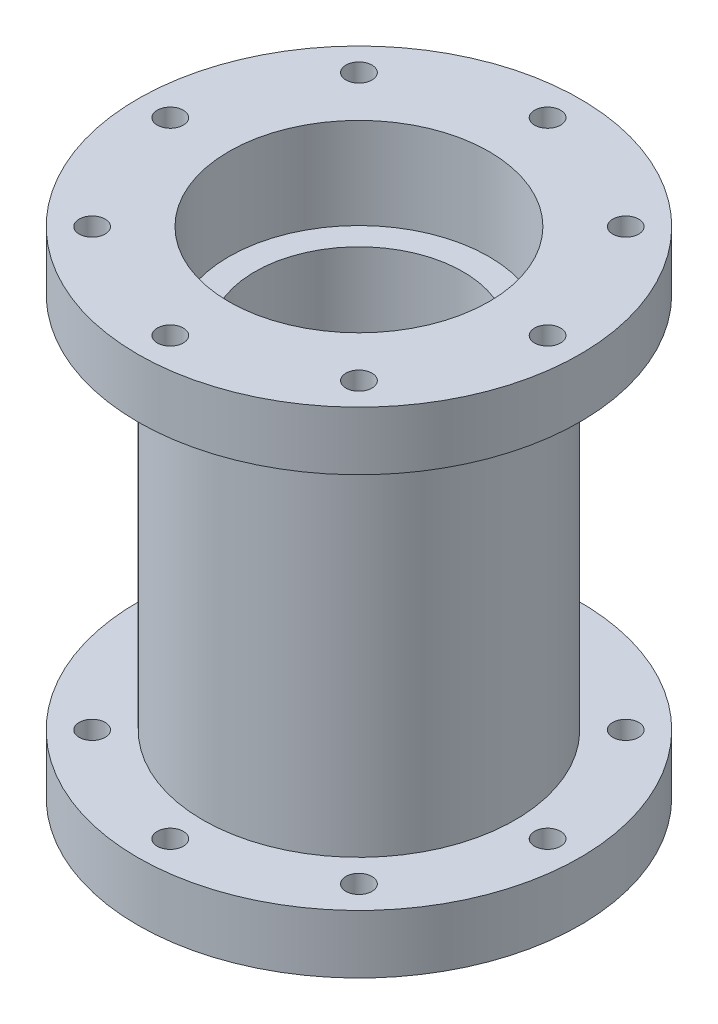
ISO-10303-21;
HEADER;
FILE_DESCRIPTION(('STEP AP214'),'2;1');
FILE_NAME('part.step','',(''),(''),'','','');
FILE_SCHEMA(('AUTOMOTIVE_DESIGN { 1 0 10303 214 1 1 1 1 }'));
ENDSEC;
DATA;
#1=APPLICATION_CONTEXT('core data for automotive mechanical design processes');
#2=APPLICATION_PROTOCOL_DEFINITION('international standard','automotive_design',2000,#1);
#3=PRODUCT_CONTEXT('',#1,'mechanical');
#4=PRODUCT('Part','Part','',(#3));
#5=PRODUCT_RELATED_PRODUCT_CATEGORY('part','',(#4));
#6=PRODUCT_DEFINITION_FORMATION('','',#4);
#7=PRODUCT_DEFINITION_CONTEXT('part definition',#1,'design');
#8=PRODUCT_DEFINITION('design','',#6,#7);
#9=PRODUCT_DEFINITION_SHAPE('','',#8);
#10=(LENGTH_UNIT() NAMED_UNIT(*) SI_UNIT(.MILLI.,.METRE.));
#11=(NAMED_UNIT(*) PLANE_ANGLE_UNIT() SI_UNIT($,.RADIAN.));
#12=(NAMED_UNIT(*) SI_UNIT($,.STERADIAN.) SOLID_ANGLE_UNIT());
#13=UNCERTAINTY_MEASURE_WITH_UNIT(LENGTH_MEASURE(1.E-05),#10,'distance_accuracy_value','');
#14=(GEOMETRIC_REPRESENTATION_CONTEXT(3) GLOBAL_UNCERTAINTY_ASSIGNED_CONTEXT((#13)) GLOBAL_UNIT_ASSIGNED_CONTEXT((#10,
#11,#12)) REPRESENTATION_CONTEXT('',''));
#15=CARTESIAN_POINT('',(0.,0.,0.));
#16=DIRECTION('',(0.,0.,1.));
#17=DIRECTION('',(1.,0.,0.));
#18=AXIS2_PLACEMENT_3D('',#15,#16,#17);
#19=CARTESIAN_POINT('',(0.,75.0967815173013,0.));
#20=DIRECTION('',(0.,1.,0.));
#21=DIRECTION('',(0.,0.,1.));
#22=AXIS2_PLACEMENT_3D('',#19,#20,#21);
#23=CYLINDRICAL_SURFACE('',#22,24.);
#24=CARTESIAN_POINT('',(0.,29.,0.));
#25=DIRECTION('',(0.,1.,0.));
#26=DIRECTION('',(0.,0.,1.));
#27=AXIS2_PLACEMENT_3D('',#24,#25,#26);
#28=CIRCLE('',#27,24.);
#29=CARTESIAN_POINT('',(0.,29.,24.));
#30=VERTEX_POINT('',#29);
#31=EDGE_CURVE('E90',#30,#30,#28,.T.);
#32=ORIENTED_EDGE('',*,*,#31,.F.);
#33=EDGE_LOOP('',(#32));
#34=FACE_BOUND('',#33,.T.);
#35=CARTESIAN_POINT('',(0.,-29.,0.));
#36=DIRECTION('',(0.,1.,0.));
#37=DIRECTION('',(0.,0.,1.));
#38=AXIS2_PLACEMENT_3D('',#35,#36,#37);
#39=CIRCLE('',#38,24.);
#40=CARTESIAN_POINT('',(0.,-29.,24.));
#41=VERTEX_POINT('',#40);
#42=EDGE_CURVE('E166',#41,#41,#39,.T.);
#43=ORIENTED_EDGE('',*,*,#42,.T.);
#44=EDGE_LOOP('',(#43));
#45=FACE_BOUND('',#44,.T.);
#46=ADVANCED_FACE('F37',(#34,#45),#23,.T.);
#47=CARTESIAN_POINT('',(-12.,-8.,0.));
#48=DIRECTION('',(0.,-1.,0.));
#49=DIRECTION('',(0.,0.,-1.));
#50=AXIS2_PLACEMENT_3D('',#47,#48,#49);
#51=PLANE('',#50);
#52=CARTESIAN_POINT('',(0.,-8.00000000000001,0.));
#53=DIRECTION('',(0.,1.,0.));
#54=DIRECTION('',(0.,0.,1.));
#55=AXIS2_PLACEMENT_3D('',#52,#53,#54);
#56=CIRCLE('',#55,12.);
#57=CARTESIAN_POINT('',(0.,-8.00000000000001,12.));
#58=VERTEX_POINT('',#57);
#59=EDGE_CURVE('E10',#58,#58,#56,.T.);
#60=ORIENTED_EDGE('',*,*,#59,.T.);
#61=EDGE_LOOP('',(#60));
#62=FACE_BOUND('',#61,.T.);
#63=CARTESIAN_POINT('',(0.,-8.00000000000001,0.));
#64=DIRECTION('',(0.,1.,0.));
#65=DIRECTION('',(0.,0.,1.));
#66=AXIS2_PLACEMENT_3D('',#63,#64,#65);
#67=CIRCLE('',#66,16.);
#68=CARTESIAN_POINT('',(0.,-8.00000000000001,16.));
#69=VERTEX_POINT('',#68);
#70=EDGE_CURVE('E81',#69,#69,#67,.T.);
#71=ORIENTED_EDGE('',*,*,#70,.F.);
#72=EDGE_LOOP('',(#71));
#73=FACE_BOUND('',#72,.T.);
#74=ADVANCED_FACE('F39',(#62,#73),#51,.T.);
#75=CARTESIAN_POINT('',(0.,75.0967815173013,0.));
#76=DIRECTION('',(0.,1.,0.));
#77=DIRECTION('',(0.,0.,1.));
#78=AXIS2_PLACEMENT_3D('',#75,#76,#77);
#79=CYLINDRICAL_SURFACE('',#78,12.);
#80=CARTESIAN_POINT('',(0.,8.00000000000001,0.));
#81=DIRECTION('',(0.,1.,0.));
#82=DIRECTION('',(0.,0.,1.));
#83=AXIS2_PLACEMENT_3D('',#80,#81,#82);
#84=CIRCLE('',#83,12.);
#85=CARTESIAN_POINT('',(0.,8.00000000000001,12.));
#86=VERTEX_POINT('',#85);
#87=EDGE_CURVE('E45',#86,#86,#84,.T.);
#88=ORIENTED_EDGE('',*,*,#87,.T.);
#89=EDGE_LOOP('',(#88));
#90=FACE_BOUND('',#89,.T.);
#91=ORIENTED_EDGE('',*,*,#59,.F.);
#92=EDGE_LOOP('',(#91));
#93=FACE_BOUND('',#92,.T.);
#94=ADVANCED_FACE('F265',(#90,#93),#79,.F.);
#95=CARTESIAN_POINT('',(-12.,8.,0.));
#96=DIRECTION('',(0.,1.,0.));
#97=DIRECTION('',(0.,0.,1.));
#98=AXIS2_PLACEMENT_3D('',#95,#96,#97);
#99=PLANE('',#98);
#100=CARTESIAN_POINT('',(0.,7.99999999999999,0.));
#101=DIRECTION('',(0.,1.,0.));
#102=DIRECTION('',(0.,0.,1.));
#103=AXIS2_PLACEMENT_3D('',#100,#101,#102);
#104=CIRCLE('',#103,16.);
#105=CARTESIAN_POINT('',(0.,7.99999999999999,16.));
#106=VERTEX_POINT('',#105);
#107=EDGE_CURVE('E50',#106,#106,#104,.T.);
#108=ORIENTED_EDGE('',*,*,#107,.T.);
#109=EDGE_LOOP('',(#108));
#110=FACE_BOUND('',#109,.T.);
#111=ORIENTED_EDGE('',*,*,#87,.F.);
#112=EDGE_LOOP('',(#111));
#113=FACE_BOUND('',#112,.T.);
#114=ADVANCED_FACE('F287',(#110,#113),#99,.T.);
#115=CARTESIAN_POINT('',(0.,75.0967815173013,0.));
#116=DIRECTION('',(0.,1.,0.));
#117=DIRECTION('',(0.,0.,1.));
#118=AXIS2_PLACEMENT_3D('',#115,#116,#117);
#119=CYLINDRICAL_SURFACE('',#118,16.);
#120=CARTESIAN_POINT('',(0.,24.,0.));
#121=DIRECTION('',(0.,1.,0.));
#122=DIRECTION('',(0.,0.,1.));
#123=AXIS2_PLACEMENT_3D('',#120,#121,#122);
#124=CIRCLE('',#123,16.);
#125=CARTESIAN_POINT('',(0.,24.,16.));
#126=VERTEX_POINT('',#125);
#127=EDGE_CURVE('E55',#126,#126,#124,.T.);
#128=ORIENTED_EDGE('',*,*,#127,.T.);
#129=EDGE_LOOP('',(#128));
#130=FACE_BOUND('',#129,.T.);
#131=ORIENTED_EDGE('',*,*,#107,.F.);
#132=EDGE_LOOP('',(#131));
#133=FACE_BOUND('',#132,.T.);
#134=ADVANCED_FACE('F283',(#130,#133),#119,.F.);
#135=CARTESIAN_POINT('',(-16.,24.,0.));
#136=DIRECTION('',(0.,1.,0.));
#137=DIRECTION('',(0.,0.,1.));
#138=AXIS2_PLACEMENT_3D('',#135,#136,#137);
#139=PLANE('',#138);
#140=CARTESIAN_POINT('',(0.,24.,0.));
#141=DIRECTION('',(0.,1.,0.));
#142=DIRECTION('',(0.,0.,1.));
#143=AXIS2_PLACEMENT_3D('',#140,#141,#142);
#144=CIRCLE('',#143,20.);
#145=CARTESIAN_POINT('',(0.,24.,20.));
#146=VERTEX_POINT('',#145);
#147=EDGE_CURVE('E61',#146,#146,#144,.T.);
#148=ORIENTED_EDGE('',*,*,#147,.T.);
#149=EDGE_LOOP('',(#148));
#150=FACE_BOUND('',#149,.T.);
#151=ORIENTED_EDGE('',*,*,#127,.F.);
#152=EDGE_LOOP('',(#151));
#153=FACE_BOUND('',#152,.T.);
#154=ADVANCED_FACE('F279',(#150,#153),#139,.T.);
#155=CARTESIAN_POINT('',(0.,75.0967815173013,0.));
#156=DIRECTION('',(0.,1.,0.));
#157=DIRECTION('',(0.,0.,1.));
#158=AXIS2_PLACEMENT_3D('',#155,#156,#157);
#159=CYLINDRICAL_SURFACE('',#158,20.);
#160=CARTESIAN_POINT('',(0.,38.,0.));
#161=DIRECTION('',(0.,1.,0.));
#162=DIRECTION('',(0.,0.,1.));
#163=AXIS2_PLACEMENT_3D('',#160,#161,#162);
#164=CIRCLE('',#163,20.);
#165=CARTESIAN_POINT('',(0.,38.,20.));
#166=VERTEX_POINT('',#165);
#167=EDGE_CURVE('E65',#166,#166,#164,.T.);
#168=ORIENTED_EDGE('',*,*,#167,.T.);
#169=EDGE_LOOP('',(#168));
#170=FACE_BOUND('',#169,.T.);
#171=ORIENTED_EDGE('',*,*,#147,.F.);
#172=EDGE_LOOP('',(#171));
#173=FACE_BOUND('',#172,.T.);
#174=ADVANCED_FACE('F275',(#170,#173),#159,.F.);
#175=CARTESIAN_POINT('',(-24.,38.,0.));
#176=DIRECTION('',(0.,1.,0.));
#177=DIRECTION('',(0.,0.,1.));
#178=AXIS2_PLACEMENT_3D('',#175,#176,#177);
#179=PLANE('',#178);
#180=ORIENTED_EDGE('',*,*,#167,.F.);
#181=EDGE_LOOP('',(#180));
#182=FACE_BOUND('',#181,.T.);
#183=CARTESIAN_POINT('',(-20.5060966544096,38.,-20.5060966544101));
#184=DIRECTION('',(0.,1.,0.));
#185=DIRECTION('',(0.,0.,1.));
#186=AXIS2_PLACEMENT_3D('',#183,#184,#185);
#187=CIRCLE('',#186,2.);
#188=CARTESIAN_POINT('',(-20.5060966544096,38.,-18.5060966544101));
#189=VERTEX_POINT('',#188);
#190=EDGE_CURVE('E154',#189,#189,#187,.T.);
#191=ORIENTED_EDGE('',*,*,#190,.F.);
#192=EDGE_LOOP('',(#191));
#193=FACE_BOUND('',#192,.T.);
#194=CARTESIAN_POINT('',(-29.,38.,0.));
#195=DIRECTION('',(0.,1.,0.));
#196=DIRECTION('',(0.,0.,1.));
#197=AXIS2_PLACEMENT_3D('',#194,#195,#196);
#198=CIRCLE('',#197,2.00000000000029);
#199=CARTESIAN_POINT('',(-29.,38.,2.0000000000003));
#200=VERTEX_POINT('',#199);
#201=EDGE_CURVE('E146',#200,#200,#198,.T.);
#202=ORIENTED_EDGE('',*,*,#201,.F.);
#203=EDGE_LOOP('',(#202));
#204=FACE_BOUND('',#203,.T.);
#205=CARTESIAN_POINT('',(-20.5060966544101,38.,20.5060966544097));
#206=DIRECTION('',(0.,1.,0.));
#207=DIRECTION('',(0.,0.,1.));
#208=AXIS2_PLACEMENT_3D('',#205,#206,#207);
#209=CIRCLE('',#208,2.);
#210=CARTESIAN_POINT('',(-20.5060966544101,38.,22.5060966544097));
#211=VERTEX_POINT('',#210);
#212=EDGE_CURVE('E138',#211,#211,#209,.T.);
#213=ORIENTED_EDGE('',*,*,#212,.F.);
#214=EDGE_LOOP('',(#213));
#215=FACE_BOUND('',#214,.T.);
#216=CARTESIAN_POINT('',(20.5060966544098,38.,20.50609665441));
#217=DIRECTION('',(0.,1.,0.));
#218=DIRECTION('',(0.,0.,1.));
#219=AXIS2_PLACEMENT_3D('',#216,#217,#218);
#220=CIRCLE('',#219,2.);
#221=CARTESIAN_POINT('',(20.5060966544098,38.,22.50609665441));
#222=VERTEX_POINT('',#221);
#223=EDGE_CURVE('E130',#222,#222,#220,.T.);
#224=ORIENTED_EDGE('',*,*,#223,.F.);
#225=EDGE_LOOP('',(#224));
#226=FACE_BOUND('',#225,.T.);
#227=CARTESIAN_POINT('',(29.,38.,4.96130914129367E-13));
#228=DIRECTION('',(0.,1.,0.));
#229=DIRECTION('',(0.,0.,1.));
#230=AXIS2_PLACEMENT_3D('',#227,#228,#229);
#231=CIRCLE('',#230,2.);
#232=CARTESIAN_POINT('',(29.,38.,2.0000000000005));
#233=VERTEX_POINT('',#232);
#234=EDGE_CURVE('E122',#233,#233,#231,.T.);
#235=ORIENTED_EDGE('',*,*,#234,.F.);
#236=EDGE_LOOP('',(#235));
#237=FACE_BOUND('',#236,.T.);
#238=CARTESIAN_POINT('',(20.5060966544102,38.,-20.5060966544096));
#239=DIRECTION('',(0.,1.,0.));
#240=DIRECTION('',(0.,0.,1.));
#241=AXIS2_PLACEMENT_3D('',#238,#239,#240);
#242=CIRCLE('',#241,2.);
#243=CARTESIAN_POINT('',(20.5060966544102,38.,-18.5060966544096));
#244=VERTEX_POINT('',#243);
#245=EDGE_CURVE('E114',#244,#244,#242,.T.);
#246=ORIENTED_EDGE('',*,*,#245,.F.);
#247=EDGE_LOOP('',(#246));
#248=FACE_BOUND('',#247,.T.);
#249=CARTESIAN_POINT('',(-1.94289029309402E-13,38.,29.));
#250=DIRECTION('',(0.,1.,0.));
#251=DIRECTION('',(0.,0.,1.));
#252=AXIS2_PLACEMENT_3D('',#249,#250,#251);
#253=CIRCLE('',#252,2.00000000000027);
#254=CARTESIAN_POINT('',(-1.94289029309402E-13,38.,31.0000000000003));
#255=VERTEX_POINT('',#254);
#256=EDGE_CURVE('E106',#255,#255,#253,.T.);
#257=ORIENTED_EDGE('',*,*,#256,.F.);
#258=EDGE_LOOP('',(#257));
#259=FACE_BOUND('',#258,.T.);
#260=CARTESIAN_POINT('',(0.,38.,-29.));
#261=DIRECTION('',(0.,1.,0.));
#262=DIRECTION('',(0.,0.,1.));
#263=AXIS2_PLACEMENT_3D('',#260,#261,#262);
#264=CIRCLE('',#263,2.);
#265=CARTESIAN_POINT('',(0.,38.,-27.));
#266=VERTEX_POINT('',#265);
#267=EDGE_CURVE('E98',#266,#266,#264,.T.);
#268=ORIENTED_EDGE('',*,*,#267,.F.);
#269=EDGE_LOOP('',(#268));
#270=FACE_BOUND('',#269,.T.);
#271=CARTESIAN_POINT('',(0.,38.,0.));
#272=DIRECTION('',(0.,1.,0.));
#273=DIRECTION('',(0.,0.,1.));
#274=AXIS2_PLACEMENT_3D('',#271,#272,#273);
#275=CIRCLE('',#274,34.);
#276=CARTESIAN_POINT('',(0.,38.,34.));
#277=VERTEX_POINT('',#276);
#278=EDGE_CURVE('E86',#277,#277,#275,.T.);
#279=ORIENTED_EDGE('',*,*,#278,.T.);
#280=EDGE_LOOP('',(#279));
#281=FACE_BOUND('',#280,.T.);
#282=ADVANCED_FACE('F272',(#182,#193,#204,#215,#226,#237,#248,#259,#270,#281),#179,.T.);
#283=CARTESIAN_POINT('',(-24.,-38.,0.));
#284=DIRECTION('',(0.,-1.,0.));
#285=DIRECTION('',(0.,0.,-1.));
#286=AXIS2_PLACEMENT_3D('',#283,#284,#285);
#287=PLANE('',#286);
#288=CARTESIAN_POINT('',(0.,-38.,0.));
#289=DIRECTION('',(0.,1.,0.));
#290=DIRECTION('',(0.,0.,1.));
#291=AXIS2_PLACEMENT_3D('',#288,#289,#290);
#292=CIRCLE('',#291,20.);
#293=CARTESIAN_POINT('',(0.,-38.,20.));
#294=VERTEX_POINT('',#293);
#295=EDGE_CURVE('E69',#294,#294,#292,.T.);
#296=ORIENTED_EDGE('',*,*,#295,.T.);
#297=EDGE_LOOP('',(#296));
#298=FACE_BOUND('',#297,.T.);
#299=CARTESIAN_POINT('',(-29.,-38.,0.));
#300=DIRECTION('',(0.,1.,0.));
#301=DIRECTION('',(0.,0.,1.));
#302=AXIS2_PLACEMENT_3D('',#299,#300,#301);
#303=CIRCLE('',#302,2.00000000000029);
#304=CARTESIAN_POINT('',(-29.,-38.,2.0000000000003));
#305=VERTEX_POINT('',#304);
#306=EDGE_CURVE('E222',#305,#305,#303,.T.);
#307=ORIENTED_EDGE('',*,*,#306,.T.);
#308=EDGE_LOOP('',(#307));
#309=FACE_BOUND('',#308,.T.);
#310=CARTESIAN_POINT('',(20.5060966544098,-38.,20.50609665441));
#311=DIRECTION('',(0.,1.,0.));
#312=DIRECTION('',(0.,0.,1.));
#313=AXIS2_PLACEMENT_3D('',#310,#311,#312);
#314=CIRCLE('',#313,2.);
#315=CARTESIAN_POINT('',(20.5060966544098,-38.,22.50609665441));
#316=VERTEX_POINT('',#315);
#317=EDGE_CURVE('E206',#316,#316,#314,.T.);
#318=ORIENTED_EDGE('',*,*,#317,.T.);
#319=EDGE_LOOP('',(#318));
#320=FACE_BOUND('',#319,.T.);
#321=CARTESIAN_POINT('',(20.5060966544102,-38.,-20.5060966544096));
#322=DIRECTION('',(0.,1.,0.));
#323=DIRECTION('',(0.,0.,1.));
#324=AXIS2_PLACEMENT_3D('',#321,#322,#323);
#325=CIRCLE('',#324,2.);
#326=CARTESIAN_POINT('',(20.5060966544102,-38.,-18.5060966544096));
#327=VERTEX_POINT('',#326);
#328=EDGE_CURVE('E190',#327,#327,#325,.T.);
#329=ORIENTED_EDGE('',*,*,#328,.T.);
#330=EDGE_LOOP('',(#329));
#331=FACE_BOUND('',#330,.T.);
#332=CARTESIAN_POINT('',(0.,-38.,-29.));
#333=DIRECTION('',(0.,1.,0.));
#334=DIRECTION('',(0.,0.,1.));
#335=AXIS2_PLACEMENT_3D('',#332,#333,#334);
#336=CIRCLE('',#335,2.);
#337=CARTESIAN_POINT('',(0.,-38.,-27.));
#338=VERTEX_POINT('',#337);
#339=EDGE_CURVE('E174',#338,#338,#336,.T.);
#340=ORIENTED_EDGE('',*,*,#339,.T.);
#341=EDGE_LOOP('',(#340));
#342=FACE_BOUND('',#341,.T.);
#343=CARTESIAN_POINT('',(0.,-38.,0.));
#344=DIRECTION('',(0.,1.,0.));
#345=DIRECTION('',(0.,0.,1.));
#346=AXIS2_PLACEMENT_3D('',#343,#344,#345);
#347=CIRCLE('',#346,34.);
#348=CARTESIAN_POINT('',(0.,-38.,34.));
#349=VERTEX_POINT('',#348);
#350=EDGE_CURVE('E162',#349,#349,#347,.T.);
#351=ORIENTED_EDGE('',*,*,#350,.F.);
#352=EDGE_LOOP('',(#351));
#353=FACE_BOUND('',#352,.T.);
#354=CARTESIAN_POINT('',(-1.94289029309402E-13,-38.,29.));
#355=DIRECTION('',(0.,1.,0.));
#356=DIRECTION('',(0.,0.,1.));
#357=AXIS2_PLACEMENT_3D('',#354,#355,#356);
#358=CIRCLE('',#357,2.00000000000027);
#359=CARTESIAN_POINT('',(-1.94289029309402E-13,-38.,31.0000000000003));
#360=VERTEX_POINT('',#359);
#361=EDGE_CURVE('E182',#360,#360,#358,.T.);
#362=ORIENTED_EDGE('',*,*,#361,.T.);
#363=EDGE_LOOP('',(#362));
#364=FACE_BOUND('',#363,.T.);
#365=CARTESIAN_POINT('',(29.,-38.,4.96130914129367E-13));
#366=DIRECTION('',(0.,1.,0.));
#367=DIRECTION('',(0.,0.,1.));
#368=AXIS2_PLACEMENT_3D('',#365,#366,#367);
#369=CIRCLE('',#368,2.);
#370=CARTESIAN_POINT('',(29.,-38.,2.0000000000005));
#371=VERTEX_POINT('',#370);
#372=EDGE_CURVE('E198',#371,#371,#369,.T.);
#373=ORIENTED_EDGE('',*,*,#372,.T.);
#374=EDGE_LOOP('',(#373));
#375=FACE_BOUND('',#374,.T.);
#376=CARTESIAN_POINT('',(-20.5060966544101,-38.,20.5060966544097));
#377=DIRECTION('',(0.,1.,0.));
#378=DIRECTION('',(0.,0.,1.));
#379=AXIS2_PLACEMENT_3D('',#376,#377,#378);
#380=CIRCLE('',#379,2.);
#381=CARTESIAN_POINT('',(-20.5060966544101,-38.,22.5060966544097));
#382=VERTEX_POINT('',#381);
#383=EDGE_CURVE('E214',#382,#382,#380,.T.);
#384=ORIENTED_EDGE('',*,*,#383,.T.);
#385=EDGE_LOOP('',(#384));
#386=FACE_BOUND('',#385,.T.);
#387=CARTESIAN_POINT('',(-20.5060966544096,-38.,-20.5060966544101));
#388=DIRECTION('',(0.,1.,0.));
#389=DIRECTION('',(0.,0.,1.));
#390=AXIS2_PLACEMENT_3D('',#387,#388,#389);
#391=CIRCLE('',#390,2.);
#392=CARTESIAN_POINT('',(-20.5060966544096,-38.,-18.5060966544101));
#393=VERTEX_POINT('',#392);
#394=EDGE_CURVE('E230',#393,#393,#391,.T.);
#395=ORIENTED_EDGE('',*,*,#394,.T.);
#396=EDGE_LOOP('',(#395));
#397=FACE_BOUND('',#396,.T.);
#398=ADVANCED_FACE('F270',(#298,#309,#320,#331,#342,#353,#364,#375,#386,#397),#287,.T.);
#399=CARTESIAN_POINT('',(0.,75.0967815173013,0.));
#400=DIRECTION('',(0.,1.,0.));
#401=DIRECTION('',(0.,0.,1.));
#402=AXIS2_PLACEMENT_3D('',#399,#400,#401);
#403=CYLINDRICAL_SURFACE('',#402,20.);
#404=CARTESIAN_POINT('',(0.,-24.,0.));
#405=DIRECTION('',(0.,1.,0.));
#406=DIRECTION('',(0.,0.,1.));
#407=AXIS2_PLACEMENT_3D('',#404,#405,#406);
#408=CIRCLE('',#407,20.);
#409=CARTESIAN_POINT('',(0.,-24.,20.));
#410=VERTEX_POINT('',#409);
#411=EDGE_CURVE('E73',#410,#410,#408,.T.);
#412=ORIENTED_EDGE('',*,*,#411,.T.);
#413=EDGE_LOOP('',(#412));
#414=FACE_BOUND('',#413,.T.);
#415=ORIENTED_EDGE('',*,*,#295,.F.);
#416=EDGE_LOOP('',(#415));
#417=FACE_BOUND('',#416,.T.);
#418=ADVANCED_FACE('F326',(#414,#417),#403,.F.);
#419=CARTESIAN_POINT('',(-16.,-24.,0.));
#420=DIRECTION('',(0.,-1.,0.));
#421=DIRECTION('',(0.,0.,-1.));
#422=AXIS2_PLACEMENT_3D('',#419,#420,#421);
#423=PLANE('',#422);
#424=CARTESIAN_POINT('',(0.,-24.,0.));
#425=DIRECTION('',(0.,1.,0.));
#426=DIRECTION('',(0.,0.,1.));
#427=AXIS2_PLACEMENT_3D('',#424,#425,#426);
#428=CIRCLE('',#427,16.);
#429=CARTESIAN_POINT('',(0.,-24.,16.));
#430=VERTEX_POINT('',#429);
#431=EDGE_CURVE('E77',#430,#430,#428,.T.);
#432=ORIENTED_EDGE('',*,*,#431,.T.);
#433=EDGE_LOOP('',(#432));
#434=FACE_BOUND('',#433,.T.);
#435=ORIENTED_EDGE('',*,*,#411,.F.);
#436=EDGE_LOOP('',(#435));
#437=FACE_BOUND('',#436,.T.);
#438=ADVANCED_FACE('F332',(#434,#437),#423,.T.);
#439=CARTESIAN_POINT('',(0.,75.0967815173013,0.));
#440=DIRECTION('',(0.,1.,0.));
#441=DIRECTION('',(0.,0.,1.));
#442=AXIS2_PLACEMENT_3D('',#439,#440,#441);
#443=CYLINDRICAL_SURFACE('',#442,16.);
#444=ORIENTED_EDGE('',*,*,#70,.T.);
#445=EDGE_LOOP('',(#444));
#446=FACE_BOUND('',#445,.T.);
#447=ORIENTED_EDGE('',*,*,#431,.F.);
#448=EDGE_LOOP('',(#447));
#449=FACE_BOUND('',#448,.T.);
#450=ADVANCED_FACE('F339',(#446,#449),#443,.F.);
#451=CARTESIAN_POINT('',(0.,29.,0.));
#452=DIRECTION('',(0.,1.,0.));
#453=DIRECTION('',(0.,0.,1.));
#454=AXIS2_PLACEMENT_3D('',#451,#452,#453);
#455=CYLINDRICAL_SURFACE('',#454,34.);
#456=CARTESIAN_POINT('',(0.,29.,0.));
#457=DIRECTION('',(0.,1.,0.));
#458=DIRECTION('',(0.,0.,1.));
#459=AXIS2_PLACEMENT_3D('',#456,#457,#458);
#460=CIRCLE('',#459,34.);
#461=CARTESIAN_POINT('',(0.,29.,34.));
#462=VERTEX_POINT('',#461);
#463=EDGE_CURVE('E85',#462,#462,#460,.T.);
#464=ORIENTED_EDGE('',*,*,#463,.T.);
#465=EDGE_LOOP('',(#464));
#466=FACE_BOUND('',#465,.T.);
#467=ORIENTED_EDGE('',*,*,#278,.F.);
#468=EDGE_LOOP('',(#467));
#469=FACE_BOUND('',#468,.T.);
#470=ADVANCED_FACE('F346',(#466,#469),#455,.T.);
#471=CARTESIAN_POINT('',(0.,29.,0.));
#472=DIRECTION('',(0.,1.,0.));
#473=DIRECTION('',(0.,0.,1.));
#474=AXIS2_PLACEMENT_3D('',#471,#472,#473);
#475=PLANE('',#474);
#476=CARTESIAN_POINT('',(-20.5060966544096,29.,-20.5060966544101));
#477=DIRECTION('',(0.,1.,0.));
#478=DIRECTION('',(0.,0.,1.));
#479=AXIS2_PLACEMENT_3D('',#476,#477,#478);
#480=CIRCLE('',#479,2.);
#481=CARTESIAN_POINT('',(-20.5060966544096,29.,-18.5060966544101));
#482=VERTEX_POINT('',#481);
#483=EDGE_CURVE('E150',#482,#482,#480,.T.);
#484=ORIENTED_EDGE('',*,*,#483,.T.);
#485=EDGE_LOOP('',(#484));
#486=FACE_BOUND('',#485,.T.);
#487=CARTESIAN_POINT('',(-29.,29.,0.));
#488=DIRECTION('',(0.,1.,0.));
#489=DIRECTION('',(0.,0.,1.));
#490=AXIS2_PLACEMENT_3D('',#487,#488,#489);
#491=CIRCLE('',#490,2.00000000000029);
#492=CARTESIAN_POINT('',(-29.,29.,2.0000000000003));
#493=VERTEX_POINT('',#492);
#494=EDGE_CURVE('E142',#493,#493,#491,.T.);
#495=ORIENTED_EDGE('',*,*,#494,.T.);
#496=EDGE_LOOP('',(#495));
#497=FACE_BOUND('',#496,.T.);
#498=CARTESIAN_POINT('',(-20.5060966544101,29.,20.5060966544097));
#499=DIRECTION('',(0.,1.,0.));
#500=DIRECTION('',(0.,0.,1.));
#501=AXIS2_PLACEMENT_3D('',#498,#499,#500);
#502=CIRCLE('',#501,2.);
#503=CARTESIAN_POINT('',(-20.5060966544101,29.,22.5060966544097));
#504=VERTEX_POINT('',#503);
#505=EDGE_CURVE('E134',#504,#504,#502,.T.);
#506=ORIENTED_EDGE('',*,*,#505,.T.);
#507=EDGE_LOOP('',(#506));
#508=FACE_BOUND('',#507,.T.);
#509=CARTESIAN_POINT('',(20.5060966544098,29.,20.50609665441));
#510=DIRECTION('',(0.,1.,0.));
#511=DIRECTION('',(0.,0.,1.));
#512=AXIS2_PLACEMENT_3D('',#509,#510,#511);
#513=CIRCLE('',#512,2.);
#514=CARTESIAN_POINT('',(20.5060966544098,29.,22.50609665441));
#515=VERTEX_POINT('',#514);
#516=EDGE_CURVE('E126',#515,#515,#513,.T.);
#517=ORIENTED_EDGE('',*,*,#516,.T.);
#518=EDGE_LOOP('',(#517));
#519=FACE_BOUND('',#518,.T.);
#520=CARTESIAN_POINT('',(29.,29.,4.96130914129367E-13));
#521=DIRECTION('',(0.,1.,0.));
#522=DIRECTION('',(0.,0.,1.));
#523=AXIS2_PLACEMENT_3D('',#520,#521,#522);
#524=CIRCLE('',#523,2.);
#525=CARTESIAN_POINT('',(29.,29.,2.0000000000005));
#526=VERTEX_POINT('',#525);
#527=EDGE_CURVE('E118',#526,#526,#524,.T.);
#528=ORIENTED_EDGE('',*,*,#527,.T.);
#529=EDGE_LOOP('',(#528));
#530=FACE_BOUND('',#529,.T.);
#531=CARTESIAN_POINT('',(20.5060966544102,29.,-20.5060966544096));
#532=DIRECTION('',(0.,1.,0.));
#533=DIRECTION('',(0.,0.,1.));
#534=AXIS2_PLACEMENT_3D('',#531,#532,#533);
#535=CIRCLE('',#534,2.);
#536=CARTESIAN_POINT('',(20.5060966544102,29.,-18.5060966544096));
#537=VERTEX_POINT('',#536);
#538=EDGE_CURVE('E110',#537,#537,#535,.T.);
#539=ORIENTED_EDGE('',*,*,#538,.T.);
#540=EDGE_LOOP('',(#539));
#541=FACE_BOUND('',#540,.T.);
#542=CARTESIAN_POINT('',(-1.94289029309402E-13,29.,29.));
#543=DIRECTION('',(0.,1.,0.));
#544=DIRECTION('',(0.,0.,1.));
#545=AXIS2_PLACEMENT_3D('',#542,#543,#544);
#546=CIRCLE('',#545,2.00000000000027);
#547=CARTESIAN_POINT('',(-1.94289029309402E-13,29.,31.0000000000003));
#548=VERTEX_POINT('',#547);
#549=EDGE_CURVE('E102',#548,#548,#546,.T.);
#550=ORIENTED_EDGE('',*,*,#549,.T.);
#551=EDGE_LOOP('',(#550));
#552=FACE_BOUND('',#551,.T.);
#553=CARTESIAN_POINT('',(0.,29.,-29.));
#554=DIRECTION('',(0.,1.,0.));
#555=DIRECTION('',(0.,0.,1.));
#556=AXIS2_PLACEMENT_3D('',#553,#554,#555);
#557=CIRCLE('',#556,2.);
#558=CARTESIAN_POINT('',(0.,29.,-27.));
#559=VERTEX_POINT('',#558);
#560=EDGE_CURVE('E97',#559,#559,#557,.T.);
#561=ORIENTED_EDGE('',*,*,#560,.T.);
#562=EDGE_LOOP('',(#561));
#563=FACE_BOUND('',#562,.T.);
#564=ORIENTED_EDGE('',*,*,#31,.T.);
#565=EDGE_LOOP('',(#564));
#566=FACE_BOUND('',#565,.T.);
#567=ORIENTED_EDGE('',*,*,#463,.F.);
#568=EDGE_LOOP('',(#567));
#569=FACE_BOUND('',#568,.T.);
#570=ADVANCED_FACE('F353',(#486,#497,#508,#519,#530,#541,#552,#563,#566,#569),#475,.F.);
#571=CARTESIAN_POINT('',(0.,29.,-29.));
#572=DIRECTION('',(0.,1.,0.));
#573=DIRECTION('',(0.,0.,1.));
#574=AXIS2_PLACEMENT_3D('',#571,#572,#573);
#575=CYLINDRICAL_SURFACE('',#574,2.);
#576=ORIENTED_EDGE('',*,*,#560,.F.);
#577=EDGE_LOOP('',(#576));
#578=FACE_BOUND('',#577,.T.);
#579=ORIENTED_EDGE('',*,*,#267,.T.);
#580=EDGE_LOOP('',(#579));
#581=FACE_BOUND('',#580,.T.);
#582=ADVANCED_FACE('F361',(#578,#581),#575,.F.);
#583=CARTESIAN_POINT('',(-1.94289029309402E-13,29.,29.));
#584=DIRECTION('',(0.,1.,0.));
#585=DIRECTION('',(0.,0.,1.));
#586=AXIS2_PLACEMENT_3D('',#583,#584,#585);
#587=CYLINDRICAL_SURFACE('',#586,2.00000000000027);
#588=ORIENTED_EDGE('',*,*,#549,.F.);
#589=EDGE_LOOP('',(#588));
#590=FACE_BOUND('',#589,.T.);
#591=ORIENTED_EDGE('',*,*,#256,.T.);
#592=EDGE_LOOP('',(#591));
#593=FACE_BOUND('',#592,.T.);
#594=ADVANCED_FACE('F369',(#590,#593),#587,.F.);
#595=CARTESIAN_POINT('',(20.5060966544102,29.,-20.5060966544096));
#596=DIRECTION('',(0.,1.,0.));
#597=DIRECTION('',(0.,0.,1.));
#598=AXIS2_PLACEMENT_3D('',#595,#596,#597);
#599=CYLINDRICAL_SURFACE('',#598,2.);
#600=ORIENTED_EDGE('',*,*,#538,.F.);
#601=EDGE_LOOP('',(#600));
#602=FACE_BOUND('',#601,.T.);
#603=ORIENTED_EDGE('',*,*,#245,.T.);
#604=EDGE_LOOP('',(#603));
#605=FACE_BOUND('',#604,.T.);
#606=ADVANCED_FACE('F377',(#602,#605),#599,.F.);
#607=CARTESIAN_POINT('',(29.,29.,4.96130914129367E-13));
#608=DIRECTION('',(0.,1.,0.));
#609=DIRECTION('',(0.,0.,1.));
#610=AXIS2_PLACEMENT_3D('',#607,#608,#609);
#611=CYLINDRICAL_SURFACE('',#610,2.);
#612=ORIENTED_EDGE('',*,*,#527,.F.);
#613=EDGE_LOOP('',(#612));
#614=FACE_BOUND('',#613,.T.);
#615=ORIENTED_EDGE('',*,*,#234,.T.);
#616=EDGE_LOOP('',(#615));
#617=FACE_BOUND('',#616,.T.);
#618=ADVANCED_FACE('F385',(#614,#617),#611,.F.);
#619=CARTESIAN_POINT('',(20.5060966544098,29.,20.50609665441));
#620=DIRECTION('',(0.,1.,0.));
#621=DIRECTION('',(0.,0.,1.));
#622=AXIS2_PLACEMENT_3D('',#619,#620,#621);
#623=CYLINDRICAL_SURFACE('',#622,2.);
#624=ORIENTED_EDGE('',*,*,#516,.F.);
#625=EDGE_LOOP('',(#624));
#626=FACE_BOUND('',#625,.T.);
#627=ORIENTED_EDGE('',*,*,#223,.T.);
#628=EDGE_LOOP('',(#627));
#629=FACE_BOUND('',#628,.T.);
#630=ADVANCED_FACE('F393',(#626,#629),#623,.F.);
#631=CARTESIAN_POINT('',(-20.5060966544101,29.,20.5060966544097));
#632=DIRECTION('',(0.,1.,0.));
#633=DIRECTION('',(0.,0.,1.));
#634=AXIS2_PLACEMENT_3D('',#631,#632,#633);
#635=CYLINDRICAL_SURFACE('',#634,2.);
#636=ORIENTED_EDGE('',*,*,#505,.F.);
#637=EDGE_LOOP('',(#636));
#638=FACE_BOUND('',#637,.T.);
#639=ORIENTED_EDGE('',*,*,#212,.T.);
#640=EDGE_LOOP('',(#639));
#641=FACE_BOUND('',#640,.T.);
#642=ADVANCED_FACE('F401',(#638,#641),#635,.F.);
#643=CARTESIAN_POINT('',(-29.,29.,0.));
#644=DIRECTION('',(0.,1.,0.));
#645=DIRECTION('',(0.,0.,1.));
#646=AXIS2_PLACEMENT_3D('',#643,#644,#645);
#647=CYLINDRICAL_SURFACE('',#646,2.00000000000029);
#648=ORIENTED_EDGE('',*,*,#494,.F.);
#649=EDGE_LOOP('',(#648));
#650=FACE_BOUND('',#649,.T.);
#651=ORIENTED_EDGE('',*,*,#201,.T.);
#652=EDGE_LOOP('',(#651));
#653=FACE_BOUND('',#652,.T.);
#654=ADVANCED_FACE('F254',(#650,#653),#647,.F.);
#655=CARTESIAN_POINT('',(-20.5060966544096,29.,-20.5060966544101));
#656=DIRECTION('',(0.,1.,0.));
#657=DIRECTION('',(0.,0.,1.));
#658=AXIS2_PLACEMENT_3D('',#655,#656,#657);
#659=CYLINDRICAL_SURFACE('',#658,2.);
#660=ORIENTED_EDGE('',*,*,#483,.F.);
#661=EDGE_LOOP('',(#660));
#662=FACE_BOUND('',#661,.T.);
#663=ORIENTED_EDGE('',*,*,#190,.T.);
#664=EDGE_LOOP('',(#663));
#665=FACE_BOUND('',#664,.T.);
#666=ADVANCED_FACE('F244',(#662,#665),#659,.F.);
#667=CARTESIAN_POINT('',(0.,-29.,0.));
#668=DIRECTION('',(0.,-1.,0.));
#669=DIRECTION('',(0.,0.,1.));
#670=AXIS2_PLACEMENT_3D('',#667,#668,#669);
#671=PLANE('',#670);
#672=CARTESIAN_POINT('',(0.,-29.,0.));
#673=DIRECTION('',(0.,1.,0.));
#674=DIRECTION('',(0.,0.,1.));
#675=AXIS2_PLACEMENT_3D('',#672,#673,#674);
#676=CIRCLE('',#675,34.);
#677=CARTESIAN_POINT('',(0.,-29.,34.));
#678=VERTEX_POINT('',#677);
#679=EDGE_CURVE('E158',#678,#678,#676,.T.);
#680=ORIENTED_EDGE('',*,*,#679,.T.);
#681=EDGE_LOOP('',(#680));
#682=FACE_BOUND('',#681,.T.);
#683=ORIENTED_EDGE('',*,*,#42,.F.);
#684=EDGE_LOOP('',(#683));
#685=FACE_BOUND('',#684,.T.);
#686=CARTESIAN_POINT('',(0.,-29.,-29.));
#687=DIRECTION('',(0.,1.,0.));
#688=DIRECTION('',(0.,0.,1.));
#689=AXIS2_PLACEMENT_3D('',#686,#687,#688);
#690=CIRCLE('',#689,2.);
#691=CARTESIAN_POINT('',(0.,-29.,-27.));
#692=VERTEX_POINT('',#691);
#693=EDGE_CURVE('E173',#692,#692,#690,.T.);
#694=ORIENTED_EDGE('',*,*,#693,.F.);
#695=EDGE_LOOP('',(#694));
#696=FACE_BOUND('',#695,.T.);
#697=CARTESIAN_POINT('',(-1.94289029309402E-13,-29.,29.));
#698=DIRECTION('',(0.,1.,0.));
#699=DIRECTION('',(0.,0.,1.));
#700=AXIS2_PLACEMENT_3D('',#697,#698,#699);
#701=CIRCLE('',#700,2.00000000000027);
#702=CARTESIAN_POINT('',(-1.94289029309402E-13,-29.,31.0000000000003));
#703=VERTEX_POINT('',#702);
#704=EDGE_CURVE('E178',#703,#703,#701,.T.);
#705=ORIENTED_EDGE('',*,*,#704,.F.);
#706=EDGE_LOOP('',(#705));
#707=FACE_BOUND('',#706,.T.);
#708=CARTESIAN_POINT('',(20.5060966544102,-29.,-20.5060966544096));
#709=DIRECTION('',(0.,1.,0.));
#710=DIRECTION('',(0.,0.,1.));
#711=AXIS2_PLACEMENT_3D('',#708,#709,#710);
#712=CIRCLE('',#711,2.);
#713=CARTESIAN_POINT('',(20.5060966544102,-29.,-18.5060966544096));
#714=VERTEX_POINT('',#713);
#715=EDGE_CURVE('E186',#714,#714,#712,.T.);
#716=ORIENTED_EDGE('',*,*,#715,.F.);
#717=EDGE_LOOP('',(#716));
#718=FACE_BOUND('',#717,.T.);
#719=CARTESIAN_POINT('',(29.,-29.,4.96130914129367E-13));
#720=DIRECTION('',(0.,1.,0.));
#721=DIRECTION('',(0.,0.,1.));
#722=AXIS2_PLACEMENT_3D('',#719,#720,#721);
#723=CIRCLE('',#722,2.);
#724=CARTESIAN_POINT('',(29.,-29.,2.0000000000005));
#725=VERTEX_POINT('',#724);
#726=EDGE_CURVE('E194',#725,#725,#723,.T.);
#727=ORIENTED_EDGE('',*,*,#726,.F.);
#728=EDGE_LOOP('',(#727));
#729=FACE_BOUND('',#728,.T.);
#730=CARTESIAN_POINT('',(20.5060966544098,-29.,20.50609665441));
#731=DIRECTION('',(0.,1.,0.));
#732=DIRECTION('',(0.,0.,1.));
#733=AXIS2_PLACEMENT_3D('',#730,#731,#732);
#734=CIRCLE('',#733,2.);
#735=CARTESIAN_POINT('',(20.5060966544098,-29.,22.50609665441));
#736=VERTEX_POINT('',#735);
#737=EDGE_CURVE('E202',#736,#736,#734,.T.);
#738=ORIENTED_EDGE('',*,*,#737,.F.);
#739=EDGE_LOOP('',(#738));
#740=FACE_BOUND('',#739,.T.);
#741=CARTESIAN_POINT('',(-20.5060966544101,-29.,20.5060966544097));
#742=DIRECTION('',(0.,1.,0.));
#743=DIRECTION('',(0.,0.,1.));
#744=AXIS2_PLACEMENT_3D('',#741,#742,#743);
#745=CIRCLE('',#744,2.);
#746=CARTESIAN_POINT('',(-20.5060966544101,-29.,22.5060966544097));
#747=VERTEX_POINT('',#746);
#748=EDGE_CURVE('E210',#747,#747,#745,.T.);
#749=ORIENTED_EDGE('',*,*,#748,.F.);
#750=EDGE_LOOP('',(#749));
#751=FACE_BOUND('',#750,.T.);
#752=CARTESIAN_POINT('',(-29.,-29.,0.));
#753=DIRECTION('',(0.,1.,0.));
#754=DIRECTION('',(0.,0.,1.));
#755=AXIS2_PLACEMENT_3D('',#752,#753,#754);
#756=CIRCLE('',#755,2.00000000000029);
#757=CARTESIAN_POINT('',(-29.,-29.,2.0000000000003));
#758=VERTEX_POINT('',#757);
#759=EDGE_CURVE('E218',#758,#758,#756,.T.);
#760=ORIENTED_EDGE('',*,*,#759,.F.);
#761=EDGE_LOOP('',(#760));
#762=FACE_BOUND('',#761,.T.);
#763=CARTESIAN_POINT('',(-20.5060966544096,-29.,-20.5060966544101));
#764=DIRECTION('',(0.,1.,0.));
#765=DIRECTION('',(0.,0.,1.));
#766=AXIS2_PLACEMENT_3D('',#763,#764,#765);
#767=CIRCLE('',#766,2.);
#768=CARTESIAN_POINT('',(-20.5060966544096,-29.,-18.5060966544101));
#769=VERTEX_POINT('',#768);
#770=EDGE_CURVE('E226',#769,#769,#767,.T.);
#771=ORIENTED_EDGE('',*,*,#770,.F.);
#772=EDGE_LOOP('',(#771));
#773=FACE_BOUND('',#772,.T.);
#774=ADVANCED_FACE('F241',(#682,#685,#696,#707,#718,#729,#740,#751,#762,#773),#671,.F.);
#775=CARTESIAN_POINT('',(0.,-29.,0.));
#776=DIRECTION('',(0.,-1.,0.));
#777=DIRECTION('',(0.,0.,-1.));
#778=AXIS2_PLACEMENT_3D('',#775,#776,#777);
#779=CYLINDRICAL_SURFACE('',#778,34.);
#780=ORIENTED_EDGE('',*,*,#679,.F.);
#781=EDGE_LOOP('',(#780));
#782=FACE_BOUND('',#781,.T.);
#783=ORIENTED_EDGE('',*,*,#350,.T.);
#784=EDGE_LOOP('',(#783));
#785=FACE_BOUND('',#784,.T.);
#786=ADVANCED_FACE('F243',(#782,#785),#779,.T.);
#787=CARTESIAN_POINT('',(0.,-29.,-29.));
#788=DIRECTION('',(0.,-1.,0.));
#789=DIRECTION('',(0.,0.,-1.));
#790=AXIS2_PLACEMENT_3D('',#787,#788,#789);
#791=CYLINDRICAL_SURFACE('',#790,2.);
#792=ORIENTED_EDGE('',*,*,#693,.T.);
#793=EDGE_LOOP('',(#792));
#794=FACE_BOUND('',#793,.T.);
#795=ORIENTED_EDGE('',*,*,#339,.F.);
#796=EDGE_LOOP('',(#795));
#797=FACE_BOUND('',#796,.T.);
#798=ADVANCED_FACE('F251',(#794,#797),#791,.F.);
#799=CARTESIAN_POINT('',(-1.94289029309402E-13,-29.,29.));
#800=DIRECTION('',(0.,-1.,0.));
#801=DIRECTION('',(0.,0.,-1.));
#802=AXIS2_PLACEMENT_3D('',#799,#800,#801);
#803=CYLINDRICAL_SURFACE('',#802,2.00000000000027);
#804=ORIENTED_EDGE('',*,*,#704,.T.);
#805=EDGE_LOOP('',(#804));
#806=FACE_BOUND('',#805,.T.);
#807=ORIENTED_EDGE('',*,*,#361,.F.);
#808=EDGE_LOOP('',(#807));
#809=FACE_BOUND('',#808,.T.);
#810=ADVANCED_FACE('F450',(#806,#809),#803,.F.);
#811=CARTESIAN_POINT('',(20.5060966544102,-29.,-20.5060966544096));
#812=DIRECTION('',(0.,-1.,0.));
#813=DIRECTION('',(0.,0.,-1.));
#814=AXIS2_PLACEMENT_3D('',#811,#812,#813);
#815=CYLINDRICAL_SURFACE('',#814,2.);
#816=ORIENTED_EDGE('',*,*,#715,.T.);
#817=EDGE_LOOP('',(#816));
#818=FACE_BOUND('',#817,.T.);
#819=ORIENTED_EDGE('',*,*,#328,.F.);
#820=EDGE_LOOP('',(#819));
#821=FACE_BOUND('',#820,.T.);
#822=ADVANCED_FACE('F458',(#818,#821),#815,.F.);
#823=CARTESIAN_POINT('',(29.,-29.,4.96130914129367E-13));
#824=DIRECTION('',(0.,-1.,0.));
#825=DIRECTION('',(0.,0.,-1.));
#826=AXIS2_PLACEMENT_3D('',#823,#824,#825);
#827=CYLINDRICAL_SURFACE('',#826,2.);
#828=ORIENTED_EDGE('',*,*,#726,.T.);
#829=EDGE_LOOP('',(#828));
#830=FACE_BOUND('',#829,.T.);
#831=ORIENTED_EDGE('',*,*,#372,.F.);
#832=EDGE_LOOP('',(#831));
#833=FACE_BOUND('',#832,.T.);
#834=ADVANCED_FACE('F467',(#830,#833),#827,.F.);
#835=CARTESIAN_POINT('',(20.5060966544098,-29.,20.50609665441));
#836=DIRECTION('',(0.,-1.,0.));
#837=DIRECTION('',(0.,0.,-1.));
#838=AXIS2_PLACEMENT_3D('',#835,#836,#837);
#839=CYLINDRICAL_SURFACE('',#838,2.);
#840=ORIENTED_EDGE('',*,*,#737,.T.);
#841=EDGE_LOOP('',(#840));
#842=FACE_BOUND('',#841,.T.);
#843=ORIENTED_EDGE('',*,*,#317,.F.);
#844=EDGE_LOOP('',(#843));
#845=FACE_BOUND('',#844,.T.);
#846=ADVANCED_FACE('F476',(#842,#845),#839,.F.);
#847=CARTESIAN_POINT('',(-20.5060966544101,-29.,20.5060966544097));
#848=DIRECTION('',(0.,-1.,0.));
#849=DIRECTION('',(0.,0.,-1.));
#850=AXIS2_PLACEMENT_3D('',#847,#848,#849);
#851=CYLINDRICAL_SURFACE('',#850,2.);
#852=ORIENTED_EDGE('',*,*,#748,.T.);
#853=EDGE_LOOP('',(#852));
#854=FACE_BOUND('',#853,.T.);
#855=ORIENTED_EDGE('',*,*,#383,.F.);
#856=EDGE_LOOP('',(#855));
#857=FACE_BOUND('',#856,.T.);
#858=ADVANCED_FACE('F485',(#854,#857),#851,.F.);
#859=CARTESIAN_POINT('',(-29.,-29.,0.));
#860=DIRECTION('',(0.,-1.,0.));
#861=DIRECTION('',(0.,0.,-1.));
#862=AXIS2_PLACEMENT_3D('',#859,#860,#861);
#863=CYLINDRICAL_SURFACE('',#862,2.00000000000029);
#864=ORIENTED_EDGE('',*,*,#759,.T.);
#865=EDGE_LOOP('',(#864));
#866=FACE_BOUND('',#865,.T.);
#867=ORIENTED_EDGE('',*,*,#306,.F.);
#868=EDGE_LOOP('',(#867));
#869=FACE_BOUND('',#868,.T.);
#870=ADVANCED_FACE('F494',(#866,#869),#863,.F.);
#871=CARTESIAN_POINT('',(-20.5060966544096,-29.,-20.5060966544101));
#872=DIRECTION('',(0.,-1.,0.));
#873=DIRECTION('',(0.,0.,-1.));
#874=AXIS2_PLACEMENT_3D('',#871,#872,#873);
#875=CYLINDRICAL_SURFACE('',#874,2.);
#876=ORIENTED_EDGE('',*,*,#770,.T.);
#877=EDGE_LOOP('',(#876));
#878=FACE_BOUND('',#877,.T.);
#879=ORIENTED_EDGE('',*,*,#394,.F.);
#880=EDGE_LOOP('',(#879));
#881=FACE_BOUND('',#880,.T.);
#882=ADVANCED_FACE('F238',(#878,#881),#875,.F.);
#883=CLOSED_SHELL('',(#46,#74,#94,#114,#134,#154,#174,#282,#398,#418,#438,#450,#470,#570,#582,
#594,#606,#618,#630,#642,#654,#666,#774,#786,#798,#810,#822,#834,#846,#858,#870,#882));
#884=MANIFOLD_SOLID_BREP('B2',#883);
#885=ADVANCED_BREP_SHAPE_REPRESENTATION('',(#18,#884),#14);
#886=SHAPE_DEFINITION_REPRESENTATION(#9,#885);
ENDSEC;
END-ISO-10303-21;
